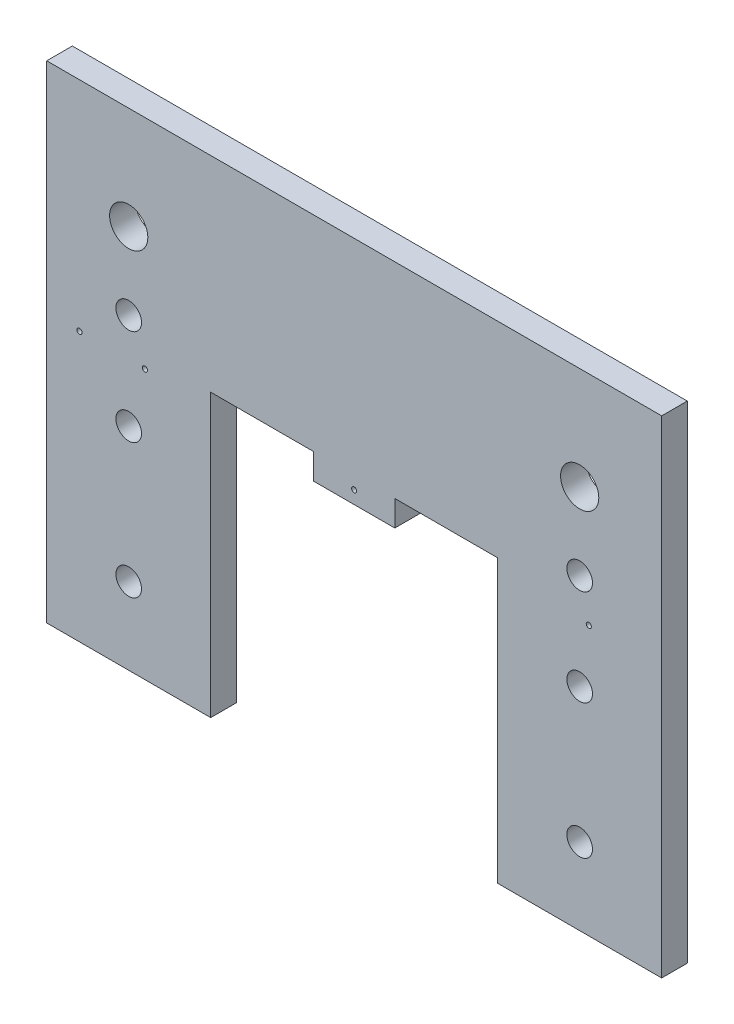
ISO-10303-21;
HEADER;
FILE_DESCRIPTION(('STEP AP214'),'2;1');
FILE_NAME('part.step','',(''),(''),'','','');
FILE_SCHEMA(('AUTOMOTIVE_DESIGN { 1 0 10303 214 1 1 1 1 }'));
ENDSEC;
DATA;
#1=APPLICATION_CONTEXT('core data for automotive mechanical design processes');
#2=APPLICATION_PROTOCOL_DEFINITION('international standard','automotive_design',2000,#1);
#3=PRODUCT_CONTEXT('',#1,'mechanical');
#4=PRODUCT('Part','Part','',(#3));
#5=PRODUCT_RELATED_PRODUCT_CATEGORY('part','',(#4));
#6=PRODUCT_DEFINITION_FORMATION('','',#4);
#7=PRODUCT_DEFINITION_CONTEXT('part definition',#1,'design');
#8=PRODUCT_DEFINITION('design','',#6,#7);
#9=PRODUCT_DEFINITION_SHAPE('','',#8);
#10=(LENGTH_UNIT() NAMED_UNIT(*) SI_UNIT(.MILLI.,.METRE.));
#11=(NAMED_UNIT(*) PLANE_ANGLE_UNIT() SI_UNIT($,.RADIAN.));
#12=(NAMED_UNIT(*) SI_UNIT($,.STERADIAN.) SOLID_ANGLE_UNIT());
#13=UNCERTAINTY_MEASURE_WITH_UNIT(LENGTH_MEASURE(1.E-05),#10,'distance_accuracy_value','');
#14=(GEOMETRIC_REPRESENTATION_CONTEXT(3) GLOBAL_UNCERTAINTY_ASSIGNED_CONTEXT((#13)) GLOBAL_UNIT_ASSIGNED_CONTEXT((#10,
#11,#12)) REPRESENTATION_CONTEXT('',''));
#15=CARTESIAN_POINT('',(0.,0.,0.));
#16=DIRECTION('',(0.,0.,1.));
#17=DIRECTION('',(1.,0.,0.));
#18=AXIS2_PLACEMENT_3D('',#15,#16,#17);
#19=CARTESIAN_POINT('',(0.,0.,6.35));
#20=DIRECTION('',(0.,0.,1.));
#21=DIRECTION('',(1.,0.,0.));
#22=AXIS2_PLACEMENT_3D('',#19,#20,#21);
#23=PLANE('',#22);
#24=CARTESIAN_POINT('',(8.11406189969159,66.675,6.35));
#25=DIRECTION('',(0.,0.,-1.));
#26=DIRECTION('',(-1.,0.,0.));
#27=AXIS2_PLACEMENT_3D('',#24,#25,#26);
#28=CIRCLE('',#27,0.634999999996417);
#29=CARTESIAN_POINT('',(7.47906189969518,66.675,6.35));
#30=VERTEX_POINT('',#29);
#31=EDGE_CURVE('E310',#30,#30,#28,.T.);
#32=ORIENTED_EDGE('',*,*,#31,.T.);
#33=EDGE_LOOP('',(#32));
#34=FACE_BOUND('',#33,.T.);
#35=CARTESIAN_POINT('',(76.1999999999997,66.675,6.35));
#36=DIRECTION('',(0.,0.,-1.));
#37=DIRECTION('',(-1.,0.,0.));
#38=AXIS2_PLACEMENT_3D('',#35,#36,#37);
#39=CIRCLE('',#38,0.635000000000003);
#40=CARTESIAN_POINT('',(75.5649999999997,66.675,6.35));
#41=VERTEX_POINT('',#40);
#42=EDGE_CURVE('E304',#41,#41,#39,.T.);
#43=ORIENTED_EDGE('',*,*,#42,.T.);
#44=EDGE_LOOP('',(#43));
#45=FACE_BOUND('',#44,.T.);
#46=CARTESIAN_POINT('',(24.3421856990748,66.675,6.35));
#47=DIRECTION('',(0.,0.,-1.));
#48=DIRECTION('',(-1.,0.,0.));
#49=AXIS2_PLACEMENT_3D('',#46,#47,#48);
#50=CIRCLE('',#49,0.634999999996417);
#51=CARTESIAN_POINT('',(23.7071856990784,66.675,6.35));
#52=VERTEX_POINT('',#51);
#53=EDGE_CURVE('E299',#52,#52,#50,.T.);
#54=ORIENTED_EDGE('',*,*,#53,.T.);
#55=EDGE_LOOP('',(#54));
#56=FACE_BOUND('',#55,.T.);
#57=CARTESIAN_POINT('',(134.339930145111,66.675,6.35));
#58=DIRECTION('',(0.,0.,-1.));
#59=DIRECTION('',(-1.,0.,0.));
#60=AXIS2_PLACEMENT_3D('',#57,#58,#59);
#61=CIRCLE('',#60,0.63499999999639);
#62=CARTESIAN_POINT('',(133.704930145114,66.675,6.35));
#63=VERTEX_POINT('',#62);
#64=EDGE_CURVE('E175',#63,#63,#61,.T.);
#65=ORIENTED_EDGE('',*,*,#64,.T.);
#66=EDGE_LOOP('',(#65));
#67=FACE_BOUND('',#66,.T.);
#68=DIRECTION('',(0.,1.,0.));
#69=VECTOR('',#68,1.);
#70=CARTESIAN_POINT('',(40.64,0.,6.35));
#71=LINE('',#70,#69);
#72=CARTESIAN_POINT('',(40.64,0.,6.35));
#73=VERTEX_POINT('',#72);
#74=CARTESIAN_POINT('',(40.64,69.85,6.35));
#75=VERTEX_POINT('',#74);
#76=EDGE_CURVE('E161',#73,#75,#71,.T.);
#77=ORIENTED_EDGE('',*,*,#76,.T.);
#78=DIRECTION('',(1.,0.,0.));
#79=VECTOR('',#78,1.);
#80=CARTESIAN_POINT('',(40.64,69.85,6.35));
#81=LINE('',#80,#79);
#82=CARTESIAN_POINT('',(66.1382895862365,69.85,6.35));
#83=VERTEX_POINT('',#82);
#84=EDGE_CURVE('E177',#75,#83,#81,.T.);
#85=ORIENTED_EDGE('',*,*,#84,.T.);
#86=DIRECTION('',(0.,-1.,0.));
#87=VECTOR('',#86,1.);
#88=CARTESIAN_POINT('',(66.1382895862365,63.5,6.35));
#89=LINE('',#88,#87);
#90=CARTESIAN_POINT('',(66.1382895862365,63.5,6.35));
#91=VERTEX_POINT('',#90);
#92=EDGE_CURVE('E183',#83,#91,#89,.T.);
#93=ORIENTED_EDGE('',*,*,#92,.T.);
#94=DIRECTION('',(1.,0.,0.));
#95=VECTOR('',#94,1.);
#96=CARTESIAN_POINT('',(40.64,63.5,6.35));
#97=LINE('',#96,#95);
#98=CARTESIAN_POINT('',(86.2617104137633,63.5,6.35));
#99=VERTEX_POINT('',#98);
#100=EDGE_CURVE('E262',#91,#99,#97,.T.);
#101=ORIENTED_EDGE('',*,*,#100,.T.);
#102=DIRECTION('',(0.,1.,0.));
#103=VECTOR('',#102,1.);
#104=CARTESIAN_POINT('',(86.2617104137633,63.5,6.35));
#105=LINE('',#104,#103);
#106=CARTESIAN_POINT('',(86.2617104137633,69.85,6.35));
#107=VERTEX_POINT('',#106);
#108=EDGE_CURVE('E193',#99,#107,#105,.T.);
#109=ORIENTED_EDGE('',*,*,#108,.T.);
#110=DIRECTION('',(1.,0.,0.));
#111=VECTOR('',#110,1.);
#112=CARTESIAN_POINT('',(111.76,69.85,6.35));
#113=LINE('',#112,#111);
#114=CARTESIAN_POINT('',(111.76,69.85,6.35));
#115=VERTEX_POINT('',#114);
#116=EDGE_CURVE('E196',#107,#115,#113,.T.);
#117=ORIENTED_EDGE('',*,*,#116,.T.);
#118=DIRECTION('',(0.,-1.,0.));
#119=VECTOR('',#118,1.);
#120=CARTESIAN_POINT('',(111.76,63.5,6.35));
#121=LINE('',#120,#119);
#122=CARTESIAN_POINT('',(111.76,0.,6.35));
#123=VERTEX_POINT('',#122);
#124=EDGE_CURVE('E111',#115,#123,#121,.T.);
#125=ORIENTED_EDGE('',*,*,#124,.T.);
#126=DIRECTION('',(1.,0.,0.));
#127=VECTOR('',#126,1.);
#128=CARTESIAN_POINT('',(111.76,0.,6.35));
#129=LINE('',#128,#127);
#130=CARTESIAN_POINT('',(152.4,0.,6.35));
#131=VERTEX_POINT('',#130);
#132=EDGE_CURVE('E102',#123,#131,#129,.T.);
#133=ORIENTED_EDGE('',*,*,#132,.T.);
#134=DIRECTION('',(0.,1.,0.));
#135=VECTOR('',#134,1.);
#136=CARTESIAN_POINT('',(152.4,69.85,6.35));
#137=LINE('',#136,#135);
#138=CARTESIAN_POINT('',(152.4,120.65,6.35));
#139=VERTEX_POINT('',#138);
#140=EDGE_CURVE('E107',#131,#139,#137,.T.);
#141=ORIENTED_EDGE('',*,*,#140,.T.);
#142=DIRECTION('',(-1.,0.,0.));
#143=VECTOR('',#142,1.);
#144=CARTESIAN_POINT('',(111.76,120.65,6.35));
#145=LINE('',#144,#143);
#146=CARTESIAN_POINT('',(0.,120.65,6.35));
#147=VERTEX_POINT('',#146);
#148=EDGE_CURVE('E57',#139,#147,#145,.T.);
#149=ORIENTED_EDGE('',*,*,#148,.T.);
#150=DIRECTION('',(0.,-1.,0.));
#151=VECTOR('',#150,1.);
#152=CARTESIAN_POINT('',(0.,69.85,6.35));
#153=LINE('',#152,#151);
#154=CARTESIAN_POINT('',(0.,0.,6.35));
#155=VERTEX_POINT('',#154);
#156=EDGE_CURVE('E150',#147,#155,#153,.T.);
#157=ORIENTED_EDGE('',*,*,#156,.T.);
#158=DIRECTION('',(1.,0.,0.));
#159=VECTOR('',#158,1.);
#160=CARTESIAN_POINT('',(0.,0.,6.35));
#161=LINE('',#160,#159);
#162=EDGE_CURVE('E92',#155,#73,#161,.T.);
#163=ORIENTED_EDGE('',*,*,#162,.T.);
#164=EDGE_LOOP('',(#77,#85,#93,#101,#109,#117,#125,#133,#141,#149,#157,#163));
#165=FACE_BOUND('',#164,.T.);
#166=CARTESIAN_POINT('',(20.32,19.05,6.35));
#167=DIRECTION('',(0.,0.,1.));
#168=DIRECTION('',(1.,0.,0.));
#169=AXIS2_PLACEMENT_3D('',#166,#167,#168);
#170=CIRCLE('',#169,3.175);
#171=CARTESIAN_POINT('',(23.495,19.05,6.35));
#172=VERTEX_POINT('',#171);
#173=EDGE_CURVE('E219',#172,#172,#170,.T.);
#174=ORIENTED_EDGE('',*,*,#173,.F.);
#175=EDGE_LOOP('',(#174));
#176=FACE_BOUND('',#175,.T.);
#177=CARTESIAN_POINT('',(20.32,52.3875,6.35));
#178=DIRECTION('',(0.,0.,1.));
#179=DIRECTION('',(1.,0.,0.));
#180=AXIS2_PLACEMENT_3D('',#177,#178,#179);
#181=CIRCLE('',#180,3.175);
#182=CARTESIAN_POINT('',(23.495,52.3875,6.35));
#183=VERTEX_POINT('',#182);
#184=EDGE_CURVE('E231',#183,#183,#181,.T.);
#185=ORIENTED_EDGE('',*,*,#184,.F.);
#186=EDGE_LOOP('',(#185));
#187=FACE_BOUND('',#186,.T.);
#188=CARTESIAN_POINT('',(132.08,76.2,6.35));
#189=DIRECTION('',(0.,0.,1.));
#190=DIRECTION('',(1.,0.,0.));
#191=AXIS2_PLACEMENT_3D('',#188,#189,#190);
#192=CIRCLE('',#191,3.17499999999997);
#193=CARTESIAN_POINT('',(135.255,76.2,6.35));
#194=VERTEX_POINT('',#193);
#195=EDGE_CURVE('E243',#194,#194,#192,.T.);
#196=ORIENTED_EDGE('',*,*,#195,.F.);
#197=EDGE_LOOP('',(#196));
#198=FACE_BOUND('',#197,.T.);
#199=CARTESIAN_POINT('',(20.32,95.25,6.35));
#200=DIRECTION('',(0.,0.,1.));
#201=DIRECTION('',(1.,0.,0.));
#202=AXIS2_PLACEMENT_3D('',#199,#200,#201);
#203=CIRCLE('',#202,4.7371);
#204=CARTESIAN_POINT('',(25.0571,95.25,6.35));
#205=VERTEX_POINT('',#204);
#206=EDGE_CURVE('E136',#205,#205,#203,.T.);
#207=ORIENTED_EDGE('',*,*,#206,.F.);
#208=EDGE_LOOP('',(#207));
#209=FACE_BOUND('',#208,.T.);
#210=CARTESIAN_POINT('',(132.08,95.25,6.35));
#211=DIRECTION('',(0.,0.,1.));
#212=DIRECTION('',(1.,0.,0.));
#213=AXIS2_PLACEMENT_3D('',#210,#211,#212);
#214=CIRCLE('',#213,4.73710000000001);
#215=CARTESIAN_POINT('',(136.8171,95.25,6.35));
#216=VERTEX_POINT('',#215);
#217=EDGE_CURVE('E249',#216,#216,#214,.T.);
#218=ORIENTED_EDGE('',*,*,#217,.F.);
#219=EDGE_LOOP('',(#218));
#220=FACE_BOUND('',#219,.T.);
#221=CARTESIAN_POINT('',(20.32,76.2,6.35));
#222=DIRECTION('',(0.,0.,1.));
#223=DIRECTION('',(1.,0.,0.));
#224=AXIS2_PLACEMENT_3D('',#221,#222,#223);
#225=CIRCLE('',#224,3.175);
#226=CARTESIAN_POINT('',(23.495,76.2,6.35));
#227=VERTEX_POINT('',#226);
#228=EDGE_CURVE('E237',#227,#227,#225,.T.);
#229=ORIENTED_EDGE('',*,*,#228,.F.);
#230=EDGE_LOOP('',(#229));
#231=FACE_BOUND('',#230,.T.);
#232=CARTESIAN_POINT('',(132.08,52.3875,6.35));
#233=DIRECTION('',(0.,0.,1.));
#234=DIRECTION('',(1.,0.,0.));
#235=AXIS2_PLACEMENT_3D('',#232,#233,#234);
#236=CIRCLE('',#235,3.175);
#237=CARTESIAN_POINT('',(135.255,52.3875,6.35));
#238=VERTEX_POINT('',#237);
#239=EDGE_CURVE('E225',#238,#238,#236,.T.);
#240=ORIENTED_EDGE('',*,*,#239,.F.);
#241=EDGE_LOOP('',(#240));
#242=FACE_BOUND('',#241,.T.);
#243=CARTESIAN_POINT('',(132.08,19.05,6.35));
#244=DIRECTION('',(0.,0.,1.));
#245=DIRECTION('',(1.,0.,0.));
#246=AXIS2_PLACEMENT_3D('',#243,#244,#245);
#247=CIRCLE('',#246,3.175);
#248=CARTESIAN_POINT('',(135.255,19.05,6.35));
#249=VERTEX_POINT('',#248);
#250=EDGE_CURVE('E213',#249,#249,#247,.T.);
#251=ORIENTED_EDGE('',*,*,#250,.F.);
#252=EDGE_LOOP('',(#251));
#253=FACE_BOUND('',#252,.T.);
#254=ADVANCED_FACE('F33',(#34,#45,#56,#67,#165,#176,#187,#198,#209,#220,#231,#242,#253),#23,.T.);
#255=CARTESIAN_POINT('',(0.,0.,0.));
#256=DIRECTION('',(0.,0.,1.));
#257=DIRECTION('',(1.,0.,0.));
#258=AXIS2_PLACEMENT_3D('',#255,#256,#257);
#259=PLANE('',#258);
#260=CARTESIAN_POINT('',(8.11406189969159,66.675,0.));
#261=DIRECTION('',(0.,0.,-1.));
#262=DIRECTION('',(-1.,0.,0.));
#263=AXIS2_PLACEMENT_3D('',#260,#261,#262);
#264=CIRCLE('',#263,0.634999999996417);
#265=CARTESIAN_POINT('',(7.47906189969518,66.675,0.));
#266=VERTEX_POINT('',#265);
#267=EDGE_CURVE('E313',#266,#266,#264,.T.);
#268=ORIENTED_EDGE('',*,*,#267,.F.);
#269=EDGE_LOOP('',(#268));
#270=FACE_BOUND('',#269,.T.);
#271=CARTESIAN_POINT('',(76.1999999999997,66.675,0.));
#272=DIRECTION('',(0.,0.,-1.));
#273=DIRECTION('',(-1.,0.,0.));
#274=AXIS2_PLACEMENT_3D('',#271,#272,#273);
#275=CIRCLE('',#274,0.635000000000003);
#276=CARTESIAN_POINT('',(75.5649999999997,66.675,0.));
#277=VERTEX_POINT('',#276);
#278=EDGE_CURVE('E307',#277,#277,#275,.T.);
#279=ORIENTED_EDGE('',*,*,#278,.F.);
#280=EDGE_LOOP('',(#279));
#281=FACE_BOUND('',#280,.T.);
#282=CARTESIAN_POINT('',(24.3421856990748,66.675,0.));
#283=DIRECTION('',(0.,0.,-1.));
#284=DIRECTION('',(-1.,0.,0.));
#285=AXIS2_PLACEMENT_3D('',#282,#283,#284);
#286=CIRCLE('',#285,0.634999999996417);
#287=CARTESIAN_POINT('',(23.7071856990784,66.675,0.));
#288=VERTEX_POINT('',#287);
#289=EDGE_CURVE('E301',#288,#288,#286,.T.);
#290=ORIENTED_EDGE('',*,*,#289,.F.);
#291=EDGE_LOOP('',(#290));
#292=FACE_BOUND('',#291,.T.);
#293=CARTESIAN_POINT('',(134.339930145111,66.675,0.));
#294=DIRECTION('',(0.,0.,-1.));
#295=DIRECTION('',(-1.,0.,0.));
#296=AXIS2_PLACEMENT_3D('',#293,#294,#295);
#297=CIRCLE('',#296,0.63499999999639);
#298=CARTESIAN_POINT('',(133.704930145114,66.675,0.));
#299=VERTEX_POINT('',#298);
#300=EDGE_CURVE('E180',#299,#299,#297,.T.);
#301=ORIENTED_EDGE('',*,*,#300,.F.);
#302=EDGE_LOOP('',(#301));
#303=FACE_BOUND('',#302,.T.);
#304=DIRECTION('',(1.,0.,0.));
#305=VECTOR('',#304,1.);
#306=CARTESIAN_POINT('',(40.64,69.85,0.));
#307=LINE('',#306,#305);
#308=CARTESIAN_POINT('',(40.64,69.85,0.));
#309=VERTEX_POINT('',#308);
#310=CARTESIAN_POINT('',(66.1382895862365,69.85,0.));
#311=VERTEX_POINT('',#310);
#312=EDGE_CURVE('E169',#309,#311,#307,.T.);
#313=ORIENTED_EDGE('',*,*,#312,.F.);
#314=DIRECTION('',(0.,1.,0.));
#315=VECTOR('',#314,1.);
#316=CARTESIAN_POINT('',(40.64,0.,0.));
#317=LINE('',#316,#315);
#318=CARTESIAN_POINT('',(40.64,0.,0.));
#319=VERTEX_POINT('',#318);
#320=EDGE_CURVE('E135',#319,#309,#317,.T.);
#321=ORIENTED_EDGE('',*,*,#320,.F.);
#322=DIRECTION('',(1.,0.,0.));
#323=VECTOR('',#322,1.);
#324=CARTESIAN_POINT('',(0.,0.,0.));
#325=LINE('',#324,#323);
#326=CARTESIAN_POINT('',(0.,0.,0.));
#327=VERTEX_POINT('',#326);
#328=EDGE_CURVE('E133',#327,#319,#325,.T.);
#329=ORIENTED_EDGE('',*,*,#328,.F.);
#330=DIRECTION('',(0.,-1.,0.));
#331=VECTOR('',#330,1.);
#332=CARTESIAN_POINT('',(0.,69.85,0.));
#333=LINE('',#332,#331);
#334=CARTESIAN_POINT('',(0.,120.65,0.));
#335=VERTEX_POINT('',#334);
#336=EDGE_CURVE('E148',#335,#327,#333,.T.);
#337=ORIENTED_EDGE('',*,*,#336,.F.);
#338=DIRECTION('',(-1.,0.,0.));
#339=VECTOR('',#338,1.);
#340=CARTESIAN_POINT('',(0.,120.65,0.));
#341=LINE('',#340,#339);
#342=CARTESIAN_POINT('',(152.4,120.65,0.));
#343=VERTEX_POINT('',#342);
#344=EDGE_CURVE('E84',#343,#335,#341,.T.);
#345=ORIENTED_EDGE('',*,*,#344,.F.);
#346=DIRECTION('',(0.,1.,0.));
#347=VECTOR('',#346,1.);
#348=CARTESIAN_POINT('',(152.4,69.85,0.));
#349=LINE('',#348,#347);
#350=CARTESIAN_POINT('',(152.4,0.,0.));
#351=VERTEX_POINT('',#350);
#352=EDGE_CURVE('E145',#351,#343,#349,.T.);
#353=ORIENTED_EDGE('',*,*,#352,.F.);
#354=DIRECTION('',(1.,0.,0.));
#355=VECTOR('',#354,1.);
#356=CARTESIAN_POINT('',(111.76,0.,0.));
#357=LINE('',#356,#355);
#358=CARTESIAN_POINT('',(111.76,0.,0.));
#359=VERTEX_POINT('',#358);
#360=EDGE_CURVE('E121',#359,#351,#357,.T.);
#361=ORIENTED_EDGE('',*,*,#360,.F.);
#362=DIRECTION('',(0.,-1.,0.));
#363=VECTOR('',#362,1.);
#364=CARTESIAN_POINT('',(111.76,63.5,0.));
#365=LINE('',#364,#363);
#366=CARTESIAN_POINT('',(111.76,69.85,0.));
#367=VERTEX_POINT('',#366);
#368=EDGE_CURVE('E142',#367,#359,#365,.T.);
#369=ORIENTED_EDGE('',*,*,#368,.F.);
#370=DIRECTION('',(1.,0.,0.));
#371=VECTOR('',#370,1.);
#372=CARTESIAN_POINT('',(111.76,69.85,0.));
#373=LINE('',#372,#371);
#374=CARTESIAN_POINT('',(86.2617104137633,69.85,0.));
#375=VERTEX_POINT('',#374);
#376=EDGE_CURVE('E197',#375,#367,#373,.T.);
#377=ORIENTED_EDGE('',*,*,#376,.F.);
#378=DIRECTION('',(0.,1.,0.));
#379=VECTOR('',#378,1.);
#380=CARTESIAN_POINT('',(86.2617104137633,63.5,0.));
#381=LINE('',#380,#379);
#382=CARTESIAN_POINT('',(86.2617104137633,63.5,0.));
#383=VERTEX_POINT('',#382);
#384=EDGE_CURVE('E188',#383,#375,#381,.T.);
#385=ORIENTED_EDGE('',*,*,#384,.F.);
#386=DIRECTION('',(1.,0.,0.));
#387=VECTOR('',#386,1.);
#388=CARTESIAN_POINT('',(40.64,63.5,0.));
#389=LINE('',#388,#387);
#390=CARTESIAN_POINT('',(66.1382895862365,63.5,0.));
#391=VERTEX_POINT('',#390);
#392=EDGE_CURVE('E139',#391,#383,#389,.T.);
#393=ORIENTED_EDGE('',*,*,#392,.F.);
#394=DIRECTION('',(0.,-1.,0.));
#395=VECTOR('',#394,1.);
#396=CARTESIAN_POINT('',(66.1382895862365,63.5,0.));
#397=LINE('',#396,#395);
#398=EDGE_CURVE('E48',#311,#391,#397,.T.);
#399=ORIENTED_EDGE('',*,*,#398,.F.);
#400=EDGE_LOOP('',(#313,#321,#329,#337,#345,#353,#361,#369,#377,#385,#393,#399));
#401=FACE_BOUND('',#400,.T.);
#402=CARTESIAN_POINT('',(20.32,95.25,0.));
#403=DIRECTION('',(0.,0.,1.));
#404=DIRECTION('',(1.,0.,0.));
#405=AXIS2_PLACEMENT_3D('',#402,#403,#404);
#406=CIRCLE('',#405,4.7371);
#407=CARTESIAN_POINT('',(25.0571,95.25,0.));
#408=VERTEX_POINT('',#407);
#409=EDGE_CURVE('E252',#408,#408,#406,.T.);
#410=ORIENTED_EDGE('',*,*,#409,.T.);
#411=EDGE_LOOP('',(#410));
#412=FACE_BOUND('',#411,.T.);
#413=CARTESIAN_POINT('',(132.08,95.25,0.));
#414=DIRECTION('',(0.,0.,1.));
#415=DIRECTION('',(1.,0.,0.));
#416=AXIS2_PLACEMENT_3D('',#413,#414,#415);
#417=CIRCLE('',#416,4.73710000000001);
#418=CARTESIAN_POINT('',(136.8171,95.25,0.));
#419=VERTEX_POINT('',#418);
#420=EDGE_CURVE('E246',#419,#419,#417,.T.);
#421=ORIENTED_EDGE('',*,*,#420,.T.);
#422=EDGE_LOOP('',(#421));
#423=FACE_BOUND('',#422,.T.);
#424=CARTESIAN_POINT('',(132.08,76.2,0.));
#425=DIRECTION('',(0.,0.,1.));
#426=DIRECTION('',(1.,0.,0.));
#427=AXIS2_PLACEMENT_3D('',#424,#425,#426);
#428=CIRCLE('',#427,3.17499999999997);
#429=CARTESIAN_POINT('',(135.255,76.2,0.));
#430=VERTEX_POINT('',#429);
#431=EDGE_CURVE('E240',#430,#430,#428,.T.);
#432=ORIENTED_EDGE('',*,*,#431,.T.);
#433=EDGE_LOOP('',(#432));
#434=FACE_BOUND('',#433,.T.);
#435=CARTESIAN_POINT('',(20.32,76.2,0.));
#436=DIRECTION('',(0.,0.,1.));
#437=DIRECTION('',(1.,0.,0.));
#438=AXIS2_PLACEMENT_3D('',#435,#436,#437);
#439=CIRCLE('',#438,3.175);
#440=CARTESIAN_POINT('',(23.495,76.2,0.));
#441=VERTEX_POINT('',#440);
#442=EDGE_CURVE('E234',#441,#441,#439,.T.);
#443=ORIENTED_EDGE('',*,*,#442,.T.);
#444=EDGE_LOOP('',(#443));
#445=FACE_BOUND('',#444,.T.);
#446=CARTESIAN_POINT('',(20.32,52.3875,0.));
#447=DIRECTION('',(0.,0.,1.));
#448=DIRECTION('',(1.,0.,0.));
#449=AXIS2_PLACEMENT_3D('',#446,#447,#448);
#450=CIRCLE('',#449,3.175);
#451=CARTESIAN_POINT('',(23.495,52.3875,0.));
#452=VERTEX_POINT('',#451);
#453=EDGE_CURVE('E228',#452,#452,#450,.T.);
#454=ORIENTED_EDGE('',*,*,#453,.T.);
#455=EDGE_LOOP('',(#454));
#456=FACE_BOUND('',#455,.T.);
#457=CARTESIAN_POINT('',(132.08,52.3875,0.));
#458=DIRECTION('',(0.,0.,1.));
#459=DIRECTION('',(1.,0.,0.));
#460=AXIS2_PLACEMENT_3D('',#457,#458,#459);
#461=CIRCLE('',#460,3.175);
#462=CARTESIAN_POINT('',(135.255,52.3875,0.));
#463=VERTEX_POINT('',#462);
#464=EDGE_CURVE('E222',#463,#463,#461,.T.);
#465=ORIENTED_EDGE('',*,*,#464,.T.);
#466=EDGE_LOOP('',(#465));
#467=FACE_BOUND('',#466,.T.);
#468=CARTESIAN_POINT('',(20.32,19.05,0.));
#469=DIRECTION('',(0.,0.,1.));
#470=DIRECTION('',(1.,0.,0.));
#471=AXIS2_PLACEMENT_3D('',#468,#469,#470);
#472=CIRCLE('',#471,3.175);
#473=CARTESIAN_POINT('',(23.495,19.05,0.));
#474=VERTEX_POINT('',#473);
#475=EDGE_CURVE('E216',#474,#474,#472,.T.);
#476=ORIENTED_EDGE('',*,*,#475,.T.);
#477=EDGE_LOOP('',(#476));
#478=FACE_BOUND('',#477,.T.);
#479=CARTESIAN_POINT('',(132.08,19.05,0.));
#480=DIRECTION('',(0.,0.,1.));
#481=DIRECTION('',(1.,0.,0.));
#482=AXIS2_PLACEMENT_3D('',#479,#480,#481);
#483=CIRCLE('',#482,3.175);
#484=CARTESIAN_POINT('',(135.255,19.05,0.));
#485=VERTEX_POINT('',#484);
#486=EDGE_CURVE('E207',#485,#485,#483,.T.);
#487=ORIENTED_EDGE('',*,*,#486,.T.);
#488=EDGE_LOOP('',(#487));
#489=FACE_BOUND('',#488,.T.);
#490=ADVANCED_FACE('F165',(#270,#281,#292,#303,#401,#412,#423,#434,#445,#456,#467,#478,#489),
#259,.F.);
#491=CARTESIAN_POINT('',(0.,0.,6.35));
#492=DIRECTION('',(0.,1.,0.));
#493=DIRECTION('',(0.,0.,1.));
#494=AXIS2_PLACEMENT_3D('',#491,#492,#493);
#495=PLANE('',#494);
#496=ORIENTED_EDGE('',*,*,#328,.T.);
#497=DIRECTION('',(0.,0.,-1.));
#498=VECTOR('',#497,1.);
#499=CARTESIAN_POINT('',(40.64,0.,6.35));
#500=LINE('',#499,#498);
#501=EDGE_CURVE('E41',#73,#319,#500,.T.);
#502=ORIENTED_EDGE('',*,*,#501,.F.);
#503=ORIENTED_EDGE('',*,*,#162,.F.);
#504=DIRECTION('',(0.,0.,-1.));
#505=VECTOR('',#504,1.);
#506=CARTESIAN_POINT('',(0.,0.,6.35));
#507=LINE('',#506,#505);
#508=EDGE_CURVE('E11',#155,#327,#507,.T.);
#509=ORIENTED_EDGE('',*,*,#508,.T.);
#510=EDGE_LOOP('',(#496,#502,#503,#509));
#511=FACE_BOUND('',#510,.T.);
#512=ADVANCED_FACE('F35',(#511),#495,.F.);
#513=CARTESIAN_POINT('',(40.64,0.,6.35));
#514=DIRECTION('',(-1.,0.,0.));
#515=DIRECTION('',(0.,-1.,0.));
#516=AXIS2_PLACEMENT_3D('',#513,#514,#515);
#517=PLANE('',#516);
#518=ORIENTED_EDGE('',*,*,#320,.T.);
#519=DIRECTION('',(0.,0.,-1.));
#520=VECTOR('',#519,1.);
#521=CARTESIAN_POINT('',(40.64,69.85,6.35));
#522=LINE('',#521,#520);
#523=EDGE_CURVE('E191',#75,#309,#522,.T.);
#524=ORIENTED_EDGE('',*,*,#523,.F.);
#525=ORIENTED_EDGE('',*,*,#76,.F.);
#526=ORIENTED_EDGE('',*,*,#501,.T.);
#527=EDGE_LOOP('',(#518,#524,#525,#526));
#528=FACE_BOUND('',#527,.T.);
#529=ADVANCED_FACE('F157',(#528),#517,.F.);
#530=CARTESIAN_POINT('',(40.64,63.5,6.35));
#531=DIRECTION('',(0.,1.,0.));
#532=DIRECTION('',(0.,0.,1.));
#533=AXIS2_PLACEMENT_3D('',#530,#531,#532);
#534=PLANE('',#533);
#535=ORIENTED_EDGE('',*,*,#100,.F.);
#536=DIRECTION('',(0.,0.,-1.));
#537=VECTOR('',#536,1.);
#538=CARTESIAN_POINT('',(66.1382895862365,63.5,6.35));
#539=LINE('',#538,#537);
#540=EDGE_CURVE('E186',#91,#391,#539,.T.);
#541=ORIENTED_EDGE('',*,*,#540,.T.);
#542=ORIENTED_EDGE('',*,*,#392,.T.);
#543=DIRECTION('',(0.,0.,-1.));
#544=VECTOR('',#543,1.);
#545=CARTESIAN_POINT('',(86.2617104137633,63.5,6.35));
#546=LINE('',#545,#544);
#547=EDGE_CURVE('E199',#99,#383,#546,.T.);
#548=ORIENTED_EDGE('',*,*,#547,.F.);
#549=EDGE_LOOP('',(#535,#541,#542,#548));
#550=FACE_BOUND('',#549,.T.);
#551=ADVANCED_FACE('F281',(#550),#534,.F.);
#552=CARTESIAN_POINT('',(111.76,63.5,6.35));
#553=DIRECTION('',(1.,0.,0.));
#554=DIRECTION('',(0.,1.,0.));
#555=AXIS2_PLACEMENT_3D('',#552,#553,#554);
#556=PLANE('',#555);
#557=ORIENTED_EDGE('',*,*,#368,.T.);
#558=DIRECTION('',(0.,0.,-1.));
#559=VECTOR('',#558,1.);
#560=CARTESIAN_POINT('',(111.76,0.,6.35));
#561=LINE('',#560,#559);
#562=EDGE_CURVE('E124',#123,#359,#561,.T.);
#563=ORIENTED_EDGE('',*,*,#562,.F.);
#564=ORIENTED_EDGE('',*,*,#124,.F.);
#565=DIRECTION('',(0.,0.,-1.));
#566=VECTOR('',#565,1.);
#567=CARTESIAN_POINT('',(111.76,69.85,6.35));
#568=LINE('',#567,#566);
#569=EDGE_CURVE('E204',#115,#367,#568,.T.);
#570=ORIENTED_EDGE('',*,*,#569,.T.);
#571=EDGE_LOOP('',(#557,#563,#564,#570));
#572=FACE_BOUND('',#571,.T.);
#573=ADVANCED_FACE('F372',(#572),#556,.F.);
#574=CARTESIAN_POINT('',(111.76,0.,6.35));
#575=DIRECTION('',(0.,1.,0.));
#576=DIRECTION('',(-1.,0.,0.));
#577=AXIS2_PLACEMENT_3D('',#574,#575,#576);
#578=PLANE('',#577);
#579=ORIENTED_EDGE('',*,*,#360,.T.);
#580=DIRECTION('',(0.,0.,-1.));
#581=VECTOR('',#580,1.);
#582=CARTESIAN_POINT('',(152.4,0.,6.35));
#583=LINE('',#582,#581);
#584=EDGE_CURVE('E118',#131,#351,#583,.T.);
#585=ORIENTED_EDGE('',*,*,#584,.F.);
#586=ORIENTED_EDGE('',*,*,#132,.F.);
#587=ORIENTED_EDGE('',*,*,#562,.T.);
#588=EDGE_LOOP('',(#579,#585,#586,#587));
#589=FACE_BOUND('',#588,.T.);
#590=ADVANCED_FACE('F119',(#589),#578,.F.);
#591=CARTESIAN_POINT('',(152.4,69.85,6.35));
#592=DIRECTION('',(-1.,0.,0.));
#593=DIRECTION('',(0.,-1.,0.));
#594=AXIS2_PLACEMENT_3D('',#591,#592,#593);
#595=PLANE('',#594);
#596=ORIENTED_EDGE('',*,*,#352,.T.);
#597=DIRECTION('',(0.,0.,-1.));
#598=VECTOR('',#597,1.);
#599=CARTESIAN_POINT('',(152.4,120.65,6.35));
#600=LINE('',#599,#598);
#601=EDGE_CURVE('E125',#139,#343,#600,.T.);
#602=ORIENTED_EDGE('',*,*,#601,.F.);
#603=ORIENTED_EDGE('',*,*,#140,.F.);
#604=ORIENTED_EDGE('',*,*,#584,.T.);
#605=EDGE_LOOP('',(#596,#602,#603,#604));
#606=FACE_BOUND('',#605,.T.);
#607=ADVANCED_FACE('F127',(#606),#595,.F.);
#608=CARTESIAN_POINT('',(0.,120.65,6.35));
#609=DIRECTION('',(0.,-1.,0.));
#610=DIRECTION('',(1.,0.,0.));
#611=AXIS2_PLACEMENT_3D('',#608,#609,#610);
#612=PLANE('',#611);
#613=ORIENTED_EDGE('',*,*,#344,.T.);
#614=DIRECTION('',(0.,0.,-1.));
#615=VECTOR('',#614,1.);
#616=CARTESIAN_POINT('',(0.,120.65,6.35));
#617=LINE('',#616,#615);
#618=EDGE_CURVE('E129',#147,#335,#617,.T.);
#619=ORIENTED_EDGE('',*,*,#618,.F.);
#620=ORIENTED_EDGE('',*,*,#148,.F.);
#621=ORIENTED_EDGE('',*,*,#601,.T.);
#622=EDGE_LOOP('',(#613,#619,#620,#621));
#623=FACE_BOUND('',#622,.T.);
#624=ADVANCED_FACE('F364',(#623),#612,.F.);
#625=CARTESIAN_POINT('',(0.,69.85,6.35));
#626=DIRECTION('',(1.,0.,0.));
#627=DIRECTION('',(0.,0.,-1.));
#628=AXIS2_PLACEMENT_3D('',#625,#626,#627);
#629=PLANE('',#628);
#630=ORIENTED_EDGE('',*,*,#336,.T.);
#631=ORIENTED_EDGE('',*,*,#508,.F.);
#632=ORIENTED_EDGE('',*,*,#156,.F.);
#633=ORIENTED_EDGE('',*,*,#618,.T.);
#634=EDGE_LOOP('',(#630,#631,#632,#633));
#635=FACE_BOUND('',#634,.T.);
#636=ADVANCED_FACE('F361',(#635),#629,.F.);
#637=CARTESIAN_POINT('',(20.32,95.25,6.35));
#638=DIRECTION('',(0.,0.,-1.));
#639=DIRECTION('',(-1.,0.,0.));
#640=AXIS2_PLACEMENT_3D('',#637,#638,#639);
#641=CYLINDRICAL_SURFACE('',#640,4.7371);
#642=ORIENTED_EDGE('',*,*,#206,.T.);
#643=EDGE_LOOP('',(#642));
#644=FACE_BOUND('',#643,.T.);
#645=ORIENTED_EDGE('',*,*,#409,.F.);
#646=EDGE_LOOP('',(#645));
#647=FACE_BOUND('',#646,.T.);
#648=ADVANCED_FACE('F358',(#644,#647),#641,.F.);
#649=CARTESIAN_POINT('',(132.08,95.25,6.35));
#650=DIRECTION('',(0.,0.,-1.));
#651=DIRECTION('',(-1.,0.,0.));
#652=AXIS2_PLACEMENT_3D('',#649,#650,#651);
#653=CYLINDRICAL_SURFACE('',#652,4.73710000000001);
#654=ORIENTED_EDGE('',*,*,#217,.T.);
#655=EDGE_LOOP('',(#654));
#656=FACE_BOUND('',#655,.T.);
#657=ORIENTED_EDGE('',*,*,#420,.F.);
#658=EDGE_LOOP('',(#657));
#659=FACE_BOUND('',#658,.T.);
#660=ADVANCED_FACE('F417',(#656,#659),#653,.F.);
#661=CARTESIAN_POINT('',(132.08,76.2,6.35));
#662=DIRECTION('',(0.,0.,-1.));
#663=DIRECTION('',(-1.,0.,0.));
#664=AXIS2_PLACEMENT_3D('',#661,#662,#663);
#665=CYLINDRICAL_SURFACE('',#664,3.17499999999997);
#666=ORIENTED_EDGE('',*,*,#195,.T.);
#667=EDGE_LOOP('',(#666));
#668=FACE_BOUND('',#667,.T.);
#669=ORIENTED_EDGE('',*,*,#431,.F.);
#670=EDGE_LOOP('',(#669));
#671=FACE_BOUND('',#670,.T.);
#672=ADVANCED_FACE('F414',(#668,#671),#665,.F.);
#673=CARTESIAN_POINT('',(20.32,76.2,6.35));
#674=DIRECTION('',(0.,0.,-1.));
#675=DIRECTION('',(-1.,0.,0.));
#676=AXIS2_PLACEMENT_3D('',#673,#674,#675);
#677=CYLINDRICAL_SURFACE('',#676,3.175);
#678=ORIENTED_EDGE('',*,*,#228,.T.);
#679=EDGE_LOOP('',(#678));
#680=FACE_BOUND('',#679,.T.);
#681=ORIENTED_EDGE('',*,*,#442,.F.);
#682=EDGE_LOOP('',(#681));
#683=FACE_BOUND('',#682,.T.);
#684=ADVANCED_FACE('F410',(#680,#683),#677,.F.);
#685=CARTESIAN_POINT('',(20.32,52.3875,6.35));
#686=DIRECTION('',(0.,0.,-1.));
#687=DIRECTION('',(-1.,0.,0.));
#688=AXIS2_PLACEMENT_3D('',#685,#686,#687);
#689=CYLINDRICAL_SURFACE('',#688,3.175);
#690=ORIENTED_EDGE('',*,*,#184,.T.);
#691=EDGE_LOOP('',(#690));
#692=FACE_BOUND('',#691,.T.);
#693=ORIENTED_EDGE('',*,*,#453,.F.);
#694=EDGE_LOOP('',(#693));
#695=FACE_BOUND('',#694,.T.);
#696=ADVANCED_FACE('F406',(#692,#695),#689,.F.);
#697=CARTESIAN_POINT('',(132.08,52.3875,6.35));
#698=DIRECTION('',(0.,0.,-1.));
#699=DIRECTION('',(-1.,0.,0.));
#700=AXIS2_PLACEMENT_3D('',#697,#698,#699);
#701=CYLINDRICAL_SURFACE('',#700,3.175);
#702=ORIENTED_EDGE('',*,*,#239,.T.);
#703=EDGE_LOOP('',(#702));
#704=FACE_BOUND('',#703,.T.);
#705=ORIENTED_EDGE('',*,*,#464,.F.);
#706=EDGE_LOOP('',(#705));
#707=FACE_BOUND('',#706,.T.);
#708=ADVANCED_FACE('F402',(#704,#707),#701,.F.);
#709=CARTESIAN_POINT('',(20.32,19.05,6.35));
#710=DIRECTION('',(0.,0.,-1.));
#711=DIRECTION('',(-1.,0.,0.));
#712=AXIS2_PLACEMENT_3D('',#709,#710,#711);
#713=CYLINDRICAL_SURFACE('',#712,3.175);
#714=ORIENTED_EDGE('',*,*,#173,.T.);
#715=EDGE_LOOP('',(#714));
#716=FACE_BOUND('',#715,.T.);
#717=ORIENTED_EDGE('',*,*,#475,.F.);
#718=EDGE_LOOP('',(#717));
#719=FACE_BOUND('',#718,.T.);
#720=ADVANCED_FACE('F396',(#716,#719),#713,.F.);
#721=CARTESIAN_POINT('',(132.08,19.05,6.35));
#722=DIRECTION('',(0.,0.,-1.));
#723=DIRECTION('',(-1.,0.,0.));
#724=AXIS2_PLACEMENT_3D('',#721,#722,#723);
#725=CYLINDRICAL_SURFACE('',#724,3.175);
#726=ORIENTED_EDGE('',*,*,#250,.T.);
#727=EDGE_LOOP('',(#726));
#728=FACE_BOUND('',#727,.T.);
#729=ORIENTED_EDGE('',*,*,#486,.F.);
#730=EDGE_LOOP('',(#729));
#731=FACE_BOUND('',#730,.T.);
#732=ADVANCED_FACE('F390',(#728,#731),#725,.F.);
#733=CARTESIAN_POINT('',(111.76,69.85,6.35));
#734=DIRECTION('',(0.,1.,0.));
#735=DIRECTION('',(0.,0.,1.));
#736=AXIS2_PLACEMENT_3D('',#733,#734,#735);
#737=PLANE('',#736);
#738=ORIENTED_EDGE('',*,*,#376,.T.);
#739=ORIENTED_EDGE('',*,*,#569,.F.);
#740=ORIENTED_EDGE('',*,*,#116,.F.);
#741=DIRECTION('',(0.,0.,-1.));
#742=VECTOR('',#741,1.);
#743=CARTESIAN_POINT('',(86.2617104137633,69.85,6.35));
#744=LINE('',#743,#742);
#745=EDGE_CURVE('E208',#107,#375,#744,.T.);
#746=ORIENTED_EDGE('',*,*,#745,.T.);
#747=EDGE_LOOP('',(#738,#739,#740,#746));
#748=FACE_BOUND('',#747,.T.);
#749=ADVANCED_FACE('F388',(#748),#737,.F.);
#750=CARTESIAN_POINT('',(86.2617104137633,63.5,6.35));
#751=DIRECTION('',(-1.,0.,0.));
#752=DIRECTION('',(0.,0.,1.));
#753=AXIS2_PLACEMENT_3D('',#750,#751,#752);
#754=PLANE('',#753);
#755=ORIENTED_EDGE('',*,*,#384,.T.);
#756=ORIENTED_EDGE('',*,*,#745,.F.);
#757=ORIENTED_EDGE('',*,*,#108,.F.);
#758=ORIENTED_EDGE('',*,*,#547,.T.);
#759=EDGE_LOOP('',(#755,#756,#757,#758));
#760=FACE_BOUND('',#759,.T.);
#761=ADVANCED_FACE('F277',(#760),#754,.F.);
#762=CARTESIAN_POINT('',(66.1382895862365,63.5,6.35));
#763=DIRECTION('',(1.,0.,0.));
#764=DIRECTION('',(0.,0.,-1.));
#765=AXIS2_PLACEMENT_3D('',#762,#763,#764);
#766=PLANE('',#765);
#767=ORIENTED_EDGE('',*,*,#398,.T.);
#768=ORIENTED_EDGE('',*,*,#540,.F.);
#769=ORIENTED_EDGE('',*,*,#92,.F.);
#770=DIRECTION('',(0.,0.,-1.));
#771=VECTOR('',#770,1.);
#772=CARTESIAN_POINT('',(66.1382895862365,69.85,6.35));
#773=LINE('',#772,#771);
#774=EDGE_CURVE('E189',#83,#311,#773,.T.);
#775=ORIENTED_EDGE('',*,*,#774,.T.);
#776=EDGE_LOOP('',(#767,#768,#769,#775));
#777=FACE_BOUND('',#776,.T.);
#778=ADVANCED_FACE('F348',(#777),#766,.F.);
#779=CARTESIAN_POINT('',(40.64,69.85,6.35));
#780=DIRECTION('',(0.,1.,0.));
#781=DIRECTION('',(0.,0.,1.));
#782=AXIS2_PLACEMENT_3D('',#779,#780,#781);
#783=PLANE('',#782);
#784=ORIENTED_EDGE('',*,*,#312,.T.);
#785=ORIENTED_EDGE('',*,*,#774,.F.);
#786=ORIENTED_EDGE('',*,*,#84,.F.);
#787=ORIENTED_EDGE('',*,*,#523,.T.);
#788=EDGE_LOOP('',(#784,#785,#786,#787));
#789=FACE_BOUND('',#788,.T.);
#790=ADVANCED_FACE('F296',(#789),#783,.F.);
#791=CARTESIAN_POINT('',(134.339930145111,66.675,6.35));
#792=DIRECTION('',(0.,0.,-1.));
#793=DIRECTION('',(-1.,0.,0.));
#794=AXIS2_PLACEMENT_3D('',#791,#792,#793);
#795=CYLINDRICAL_SURFACE('',#794,0.63499999999639);
#796=ORIENTED_EDGE('',*,*,#64,.F.);
#797=EDGE_LOOP('',(#796));
#798=FACE_BOUND('',#797,.T.);
#799=ORIENTED_EDGE('',*,*,#300,.T.);
#800=EDGE_LOOP('',(#799));
#801=FACE_BOUND('',#800,.T.);
#802=ADVANCED_FACE('F337',(#798,#801),#795,.F.);
#803=CARTESIAN_POINT('',(24.3421856990748,66.675,6.35));
#804=DIRECTION('',(0.,0.,-1.));
#805=DIRECTION('',(-1.,0.,0.));
#806=AXIS2_PLACEMENT_3D('',#803,#804,#805);
#807=CYLINDRICAL_SURFACE('',#806,0.634999999996417);
#808=ORIENTED_EDGE('',*,*,#53,.F.);
#809=EDGE_LOOP('',(#808));
#810=FACE_BOUND('',#809,.T.);
#811=ORIENTED_EDGE('',*,*,#289,.T.);
#812=EDGE_LOOP('',(#811));
#813=FACE_BOUND('',#812,.T.);
#814=ADVANCED_FACE('F339',(#810,#813),#807,.F.);
#815=CARTESIAN_POINT('',(76.1999999999997,66.675,6.35));
#816=DIRECTION('',(0.,0.,-1.));
#817=DIRECTION('',(-1.,0.,0.));
#818=AXIS2_PLACEMENT_3D('',#815,#816,#817);
#819=CYLINDRICAL_SURFACE('',#818,0.635000000000003);
#820=ORIENTED_EDGE('',*,*,#42,.F.);
#821=EDGE_LOOP('',(#820));
#822=FACE_BOUND('',#821,.T.);
#823=ORIENTED_EDGE('',*,*,#278,.T.);
#824=EDGE_LOOP('',(#823));
#825=FACE_BOUND('',#824,.T.);
#826=ADVANCED_FACE('F324',(#822,#825),#819,.F.);
#827=CARTESIAN_POINT('',(8.11406189969159,66.675,6.35));
#828=DIRECTION('',(0.,0.,-1.));
#829=DIRECTION('',(-1.,0.,0.));
#830=AXIS2_PLACEMENT_3D('',#827,#828,#829);
#831=CYLINDRICAL_SURFACE('',#830,0.634999999996417);
#832=ORIENTED_EDGE('',*,*,#31,.F.);
#833=EDGE_LOOP('',(#832));
#834=FACE_BOUND('',#833,.T.);
#835=ORIENTED_EDGE('',*,*,#267,.T.);
#836=EDGE_LOOP('',(#835));
#837=FACE_BOUND('',#836,.T.);
#838=ADVANCED_FACE('F321',(#834,#837),#831,.F.);
#839=CLOSED_SHELL('',(#254,#490,#512,#529,#551,#573,#590,#607,#624,#636,#648,#660,#672,#684,
#696,#708,#720,#732,#749,#761,#778,#790,#802,#814,#826,#838));
#840=MANIFOLD_SOLID_BREP('B2',#839);
#841=ADVANCED_BREP_SHAPE_REPRESENTATION('',(#18,#840),#14);
#842=SHAPE_DEFINITION_REPRESENTATION(#9,#841);
ENDSEC;
END-ISO-10303-21;
